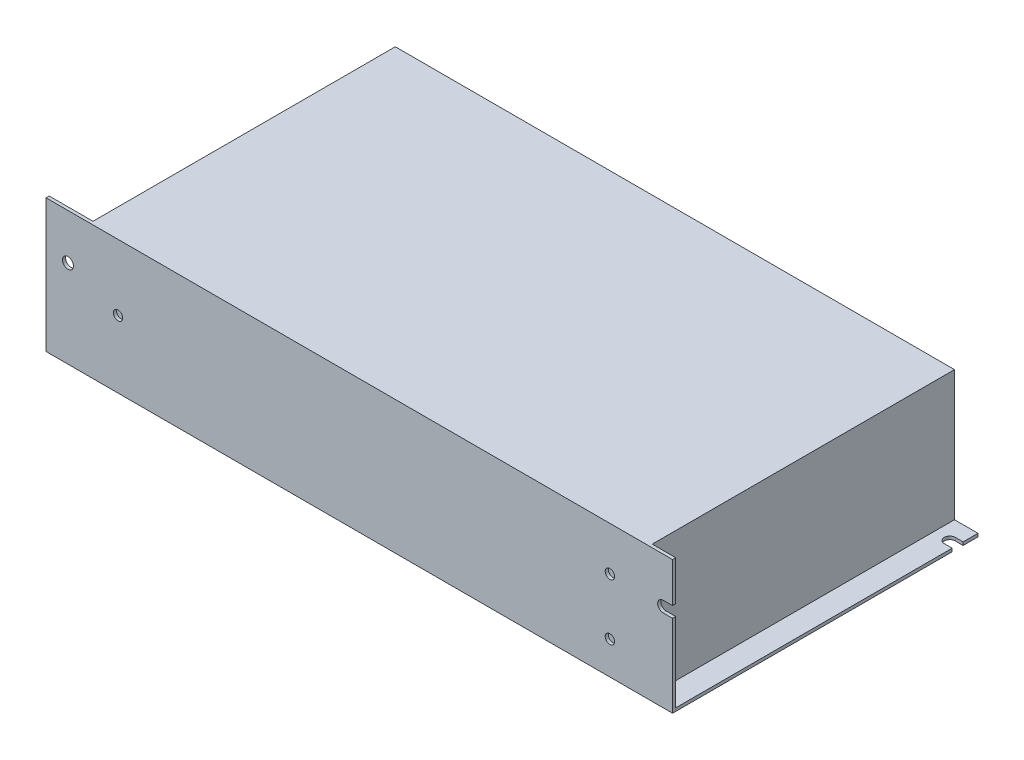
ISO-10303-21;
HEADER;
FILE_DESCRIPTION(('STEP AP214'),'2;1');
FILE_NAME('part.step','',(''),(''),'','','');
FILE_SCHEMA(('AUTOMOTIVE_DESIGN { 1 0 10303 214 1 1 1 1 }'));
ENDSEC;
DATA;
#1=APPLICATION_CONTEXT('core data for automotive mechanical design processes');
#2=APPLICATION_PROTOCOL_DEFINITION('international standard','automotive_design',2000,#1);
#3=PRODUCT_CONTEXT('',#1,'mechanical');
#4=PRODUCT('Part','Part','',(#3));
#5=PRODUCT_RELATED_PRODUCT_CATEGORY('part','',(#4));
#6=PRODUCT_DEFINITION_FORMATION('','',#4);
#7=PRODUCT_DEFINITION_CONTEXT('part definition',#1,'design');
#8=PRODUCT_DEFINITION('design','',#6,#7);
#9=PRODUCT_DEFINITION_SHAPE('','',#8);
#10=(LENGTH_UNIT() NAMED_UNIT(*) SI_UNIT(.MILLI.,.METRE.));
#11=(NAMED_UNIT(*) PLANE_ANGLE_UNIT() SI_UNIT($,.RADIAN.));
#12=(NAMED_UNIT(*) SI_UNIT($,.STERADIAN.) SOLID_ANGLE_UNIT());
#13=UNCERTAINTY_MEASURE_WITH_UNIT(LENGTH_MEASURE(1.E-05),#10,'distance_accuracy_value','');
#14=(GEOMETRIC_REPRESENTATION_CONTEXT(3) GLOBAL_UNCERTAINTY_ASSIGNED_CONTEXT((#13)) GLOBAL_UNIT_ASSIGNED_CONTEXT((#10,
#11,#12)) REPRESENTATION_CONTEXT('',''));
#15=CARTESIAN_POINT('',(0.,0.,0.));
#16=DIRECTION('',(0.,0.,1.));
#17=DIRECTION('',(1.,0.,0.));
#18=AXIS2_PLACEMENT_3D('',#15,#16,#17);
#19=CARTESIAN_POINT('',(14.,-97.510255870857,-97.5));
#20=DIRECTION('',(-1.,0.,0.));
#21=DIRECTION('',(0.,0.,1.));
#22=AXIS2_PLACEMENT_3D('',#19,#20,#21);
#23=PLANE('',#22);
#24=DIRECTION('',(0.,0.,-1.));
#25=VECTOR('',#24,1.);
#26=CARTESIAN_POINT('',(14.,1.,-97.5));
#27=LINE('',#26,#25);
#28=CARTESIAN_POINT('',(14.,1.,-87.5));
#29=VERTEX_POINT('',#28);
#30=CARTESIAN_POINT('',(14.,1.,-97.5));
#31=VERTEX_POINT('',#30);
#32=EDGE_CURVE('E213',#29,#31,#27,.T.);
#33=ORIENTED_EDGE('',*,*,#32,.F.);
#34=DIRECTION('',(0.,-1.,0.));
#35=VECTOR('',#34,1.);
#36=CARTESIAN_POINT('',(14.,24.,-87.5));
#37=LINE('',#36,#35);
#38=CARTESIAN_POINT('',(14.,24.,-87.5));
#39=VERTEX_POINT('',#38);
#40=EDGE_CURVE('E194',#39,#29,#37,.T.);
#41=ORIENTED_EDGE('',*,*,#40,.F.);
#42=DIRECTION('',(0.,0.,-1.));
#43=VECTOR('',#42,1.);
#44=CARTESIAN_POINT('',(14.,24.,-87.5));
#45=LINE('',#44,#43);
#46=CARTESIAN_POINT('',(14.,24.,-12.5));
#47=VERTEX_POINT('',#46);
#48=EDGE_CURVE('E201',#47,#39,#45,.T.);
#49=ORIENTED_EDGE('',*,*,#48,.F.);
#50=DIRECTION('',(0.,-1.,0.));
#51=VECTOR('',#50,1.);
#52=CARTESIAN_POINT('',(14.,24.,-12.5));
#53=LINE('',#52,#51);
#54=CARTESIAN_POINT('',(14.,1.,-12.5));
#55=VERTEX_POINT('',#54);
#56=EDGE_CURVE('E442',#47,#55,#53,.T.);
#57=ORIENTED_EDGE('',*,*,#56,.T.);
#58=CARTESIAN_POINT('',(14.,1.,-1.));
#59=VERTEX_POINT('',#58);
#60=EDGE_CURVE('E251',#59,#55,#27,.T.);
#61=ORIENTED_EDGE('',*,*,#60,.F.);
#62=DIRECTION('',(0.,1.,0.));
#63=VECTOR('',#62,1.);
#64=CARTESIAN_POINT('',(14.,-97.510255870857,-1.));
#65=LINE('',#64,#63);
#66=CARTESIAN_POINT('',(14.,42.5,-1.));
#67=VERTEX_POINT('',#66);
#68=EDGE_CURVE('E267',#59,#67,#65,.T.);
#69=ORIENTED_EDGE('',*,*,#68,.T.);
#70=DIRECTION('',(0.,0.,1.));
#71=VECTOR('',#70,1.);
#72=CARTESIAN_POINT('',(14.,42.5,-97.5));
#73=LINE('',#72,#71);
#74=CARTESIAN_POINT('',(14.,42.5,-97.5));
#75=VERTEX_POINT('',#74);
#76=EDGE_CURVE('E258',#75,#67,#73,.T.);
#77=ORIENTED_EDGE('',*,*,#76,.F.);
#78=DIRECTION('',(0.,1.,0.));
#79=VECTOR('',#78,1.);
#80=CARTESIAN_POINT('',(14.,-97.510255870857,-97.5));
#81=LINE('',#80,#79);
#82=EDGE_CURVE('E250',#31,#75,#81,.T.);
#83=ORIENTED_EDGE('',*,*,#82,.F.);
#84=EDGE_LOOP('',(#33,#41,#49,#57,#61,#69,#77,#83));
#85=FACE_BOUND('',#84,.T.);
#86=ADVANCED_FACE('F40',(#85),#23,.T.);
#87=CARTESIAN_POINT('',(197.5,1.,-91.));
#88=DIRECTION('',(0.,1.,0.));
#89=DIRECTION('',(0.,0.,1.));
#90=AXIS2_PLACEMENT_3D('',#87,#88,#89);
#91=PLANE('',#90);
#92=CARTESIAN_POINT('',(5.,1.,-92.5));
#93=DIRECTION('',(0.,-1.,0.));
#94=DIRECTION('',(0.,0.,-1.));
#95=AXIS2_PLACEMENT_3D('',#92,#93,#94);
#96=CIRCLE('',#95,1.5);
#97=CARTESIAN_POINT('',(5.,1.,-94.));
#98=VERTEX_POINT('',#97);
#99=EDGE_CURVE('E448',#98,#98,#96,.T.);
#100=ORIENTED_EDGE('',*,*,#99,.T.);
#101=EDGE_LOOP('',(#100));
#102=FACE_BOUND('',#101,.T.);
#103=DIRECTION('',(0.,0.,-1.));
#104=VECTOR('',#103,1.);
#105=CARTESIAN_POINT('',(0.,1.,-97.5));
#106=LINE('',#105,#104);
#107=CARTESIAN_POINT('',(0.,1.,-87.5));
#108=VERTEX_POINT('',#107);
#109=CARTESIAN_POINT('',(0.,1.,-97.5));
#110=VERTEX_POINT('',#109);
#111=EDGE_CURVE('E257',#108,#110,#106,.T.);
#112=ORIENTED_EDGE('',*,*,#111,.F.);
#113=DIRECTION('',(-1.,0.,0.));
#114=VECTOR('',#113,1.);
#115=CARTESIAN_POINT('',(14.,1.,-87.5));
#116=LINE('',#115,#114);
#117=EDGE_CURVE('E432',#29,#108,#116,.T.);
#118=ORIENTED_EDGE('',*,*,#117,.F.);
#119=ORIENTED_EDGE('',*,*,#32,.T.);
#120=DIRECTION('',(-1.,0.,0.));
#121=VECTOR('',#120,1.);
#122=CARTESIAN_POINT('',(0.,1.,-97.5));
#123=LINE('',#122,#121);
#124=EDGE_CURVE('E254',#31,#110,#123,.T.);
#125=ORIENTED_EDGE('',*,*,#124,.T.);
#126=EDGE_LOOP('',(#112,#118,#119,#125));
#127=FACE_BOUND('',#126,.T.);
#128=ADVANCED_FACE('F431',(#102,#127),#91,.T.);
#129=CARTESIAN_POINT('',(3.,1.,-7.5));
#130=DIRECTION('',(0.,1.,0.));
#131=DIRECTION('',(0.,0.,1.));
#132=AXIS2_PLACEMENT_3D('',#129,#130,#131);
#133=CIRCLE('',#132,1.5);
#134=CARTESIAN_POINT('',(3.,1.,-6.));
#135=VERTEX_POINT('',#134);
#136=EDGE_CURVE('E44',#135,#135,#133,.T.);
#137=ORIENTED_EDGE('',*,*,#136,.F.);
#138=EDGE_LOOP('',(#137));
#139=FACE_BOUND('',#138,.T.);
#140=ORIENTED_EDGE('',*,*,#60,.T.);
#141=DIRECTION('',(1.,0.,0.));
#142=VECTOR('',#141,1.);
#143=CARTESIAN_POINT('',(14.,1.,-12.5));
#144=LINE('',#143,#142);
#145=CARTESIAN_POINT('',(0.,1.,-12.5));
#146=VERTEX_POINT('',#145);
#147=EDGE_CURVE('E209',#146,#55,#144,.T.);
#148=ORIENTED_EDGE('',*,*,#147,.F.);
#149=CARTESIAN_POINT('',(0.,1.,-1.));
#150=VERTEX_POINT('',#149);
#151=EDGE_CURVE('E271',#150,#146,#106,.T.);
#152=ORIENTED_EDGE('',*,*,#151,.F.);
#153=DIRECTION('',(-1.,0.,0.));
#154=VECTOR('',#153,1.);
#155=CARTESIAN_POINT('',(0.,1.,-1.));
#156=LINE('',#155,#154);
#157=EDGE_CURVE('E248',#59,#150,#156,.T.);
#158=ORIENTED_EDGE('',*,*,#157,.F.);
#159=EDGE_LOOP('',(#140,#148,#152,#158));
#160=FACE_BOUND('',#159,.T.);
#161=ADVANCED_FACE('F540',(#139,#160),#91,.T.);
#162=CARTESIAN_POINT('',(200.,42.5,0.));
#163=DIRECTION('',(-1.,0.,0.));
#164=DIRECTION('',(0.,0.,1.));
#165=AXIS2_PLACEMENT_3D('',#162,#163,#164);
#166=PLANE('',#165);
#167=DIRECTION('',(0.,-1.,0.));
#168=VECTOR('',#167,1.);
#169=CARTESIAN_POINT('',(200.,42.5,0.));
#170=LINE('',#169,#168);
#171=CARTESIAN_POINT('',(200.,42.5,0.));
#172=VERTEX_POINT('',#171);
#173=CARTESIAN_POINT('',(200.,29.75,0.));
#174=VERTEX_POINT('',#173);
#175=EDGE_CURVE('E49',#172,#174,#170,.T.);
#176=ORIENTED_EDGE('',*,*,#175,.T.);
#177=DIRECTION('',(0.,0.,1.));
#178=VECTOR('',#177,1.);
#179=CARTESIAN_POINT('',(200.,29.75,-97.501));
#180=LINE('',#179,#178);
#181=CARTESIAN_POINT('',(200.,29.75,-1.));
#182=VERTEX_POINT('',#181);
#183=EDGE_CURVE('E243',#182,#174,#180,.T.);
#184=ORIENTED_EDGE('',*,*,#183,.F.);
#185=DIRECTION('',(0.,1.,0.));
#186=VECTOR('',#185,1.);
#187=CARTESIAN_POINT('',(200.,-97.510255870857,-1.));
#188=LINE('',#187,#186);
#189=CARTESIAN_POINT('',(200.,42.5,-1.));
#190=VERTEX_POINT('',#189);
#191=EDGE_CURVE('E284',#182,#190,#188,.T.);
#192=ORIENTED_EDGE('',*,*,#191,.T.);
#193=DIRECTION('',(0.,0.,-1.));
#194=VECTOR('',#193,1.);
#195=CARTESIAN_POINT('',(200.,42.5,0.));
#196=LINE('',#195,#194);
#197=EDGE_CURVE('E311',#172,#190,#196,.T.);
#198=ORIENTED_EDGE('',*,*,#197,.F.);
#199=EDGE_LOOP('',(#176,#184,#192,#198));
#200=FACE_BOUND('',#199,.T.);
#201=ADVANCED_FACE('F398',(#200),#166,.F.);
#202=CARTESIAN_POINT('',(197.5,42.5,-91.));
#203=DIRECTION('',(0.,1.,0.));
#204=DIRECTION('',(0.,0.,1.));
#205=AXIS2_PLACEMENT_3D('',#202,#203,#204);
#206=PLANE('',#205);
#207=DIRECTION('',(-1.,0.,0.));
#208=VECTOR('',#207,1.);
#209=CARTESIAN_POINT('',(0.,42.5,-97.5));
#210=LINE('',#209,#208);
#211=CARTESIAN_POINT('',(192.5,42.5,-97.5));
#212=VERTEX_POINT('',#211);
#213=EDGE_CURVE('E314',#212,#75,#210,.T.);
#214=ORIENTED_EDGE('',*,*,#213,.T.);
#215=ORIENTED_EDGE('',*,*,#76,.T.);
#216=DIRECTION('',(1.,0.,0.));
#217=VECTOR('',#216,1.);
#218=CARTESIAN_POINT('',(0.,42.5,-1.));
#219=LINE('',#218,#217);
#220=CARTESIAN_POINT('',(0.,42.5,-1.));
#221=VERTEX_POINT('',#220);
#222=EDGE_CURVE('E261',#221,#67,#219,.T.);
#223=ORIENTED_EDGE('',*,*,#222,.F.);
#224=DIRECTION('',(0.,0.,1.));
#225=VECTOR('',#224,1.);
#226=CARTESIAN_POINT('',(0.,42.5,0.));
#227=LINE('',#226,#225);
#228=CARTESIAN_POINT('',(0.,42.5,0.));
#229=VERTEX_POINT('',#228);
#230=EDGE_CURVE('E306',#221,#229,#227,.T.);
#231=ORIENTED_EDGE('',*,*,#230,.T.);
#232=DIRECTION('',(1.,0.,0.));
#233=VECTOR('',#232,1.);
#234=CARTESIAN_POINT('',(0.,42.5,0.));
#235=LINE('',#234,#233);
#236=EDGE_CURVE('E308',#229,#172,#235,.T.);
#237=ORIENTED_EDGE('',*,*,#236,.T.);
#238=ORIENTED_EDGE('',*,*,#197,.T.);
#239=DIRECTION('',(-1.,0.,0.));
#240=VECTOR('',#239,1.);
#241=CARTESIAN_POINT('',(200.,42.5,-1.));
#242=LINE('',#241,#240);
#243=CARTESIAN_POINT('',(192.5,42.5,-1.));
#244=VERTEX_POINT('',#243);
#245=EDGE_CURVE('E278',#190,#244,#242,.T.);
#246=ORIENTED_EDGE('',*,*,#245,.T.);
#247=DIRECTION('',(0.,0.,1.));
#248=VECTOR('',#247,1.);
#249=CARTESIAN_POINT('',(192.5,42.5,-97.5));
#250=LINE('',#249,#248);
#251=EDGE_CURVE('E262',#212,#244,#250,.T.);
#252=ORIENTED_EDGE('',*,*,#251,.F.);
#253=EDGE_LOOP('',(#214,#215,#223,#231,#237,#238,#246,#252));
#254=FACE_BOUND('',#253,.T.);
#255=ADVANCED_FACE('F402',(#254),#206,.T.);
#256=CARTESIAN_POINT('',(200.,1.,-1.));
#257=VERTEX_POINT('',#256);
#258=CARTESIAN_POINT('',(200.,26.25,-1.));
#259=VERTEX_POINT('',#258);
#260=EDGE_CURVE('E281',#257,#259,#188,.T.);
#261=ORIENTED_EDGE('',*,*,#260,.T.);
#262=DIRECTION('',(0.,0.,1.));
#263=VECTOR('',#262,1.);
#264=CARTESIAN_POINT('',(200.,26.25,-97.501));
#265=LINE('',#264,#263);
#266=CARTESIAN_POINT('',(200.,26.25,0.));
#267=VERTEX_POINT('',#266);
#268=EDGE_CURVE('E64',#259,#267,#265,.T.);
#269=ORIENTED_EDGE('',*,*,#268,.T.);
#270=CARTESIAN_POINT('',(200.,0.,0.));
#271=VERTEX_POINT('',#270);
#272=EDGE_CURVE('E351',#267,#271,#170,.T.);
#273=ORIENTED_EDGE('',*,*,#272,.T.);
#274=DIRECTION('',(0.,0.,-1.));
#275=VECTOR('',#274,1.);
#276=CARTESIAN_POINT('',(200.,0.,0.));
#277=LINE('',#276,#275);
#278=CARTESIAN_POINT('',(200.,0.,-89.25));
#279=VERTEX_POINT('',#278);
#280=EDGE_CURVE('E323',#271,#279,#277,.T.);
#281=ORIENTED_EDGE('',*,*,#280,.T.);
#282=DIRECTION('',(0.,-1.,0.));
#283=VECTOR('',#282,1.);
#284=CARTESIAN_POINT('',(200.,42.5,-89.25));
#285=LINE('',#284,#283);
#286=CARTESIAN_POINT('',(200.,1.,-89.25));
#287=VERTEX_POINT('',#286);
#288=EDGE_CURVE('E349',#287,#279,#285,.T.);
#289=ORIENTED_EDGE('',*,*,#288,.F.);
#290=DIRECTION('',(0.,0.,-1.));
#291=VECTOR('',#290,1.);
#292=CARTESIAN_POINT('',(200.,1.,-97.5));
#293=LINE('',#292,#291);
#294=EDGE_CURVE('E292',#257,#287,#293,.T.);
#295=ORIENTED_EDGE('',*,*,#294,.F.);
#296=EDGE_LOOP('',(#261,#269,#273,#281,#289,#295));
#297=FACE_BOUND('',#296,.T.);
#298=ADVANCED_FACE('F359',(#297),#166,.F.);
#299=CARTESIAN_POINT('',(197.5,42.5,-89.25));
#300=DIRECTION('',(0.,0.,1.));
#301=DIRECTION('',(1.,0.,0.));
#302=AXIS2_PLACEMENT_3D('',#299,#300,#301);
#303=PLANE('',#302);
#304=DIRECTION('',(-1.,0.,0.));
#305=VECTOR('',#304,1.);
#306=CARTESIAN_POINT('',(197.5,1.,-89.25));
#307=LINE('',#306,#305);
#308=CARTESIAN_POINT('',(197.5,1.,-89.25));
#309=VERTEX_POINT('',#308);
#310=EDGE_CURVE('E300',#287,#309,#307,.T.);
#311=ORIENTED_EDGE('',*,*,#310,.F.);
#312=ORIENTED_EDGE('',*,*,#288,.T.);
#313=DIRECTION('',(-1.,0.,0.));
#314=VECTOR('',#313,1.);
#315=CARTESIAN_POINT('',(197.5,0.,-89.25));
#316=LINE('',#315,#314);
#317=CARTESIAN_POINT('',(197.5,0.,-89.25));
#318=VERTEX_POINT('',#317);
#319=EDGE_CURVE('E326',#279,#318,#316,.T.);
#320=ORIENTED_EDGE('',*,*,#319,.T.);
#321=DIRECTION('',(0.,-1.,0.));
#322=VECTOR('',#321,1.);
#323=CARTESIAN_POINT('',(197.5,42.5,-89.25));
#324=LINE('',#323,#322);
#325=EDGE_CURVE('E347',#309,#318,#324,.T.);
#326=ORIENTED_EDGE('',*,*,#325,.F.);
#327=EDGE_LOOP('',(#311,#312,#320,#326));
#328=FACE_BOUND('',#327,.T.);
#329=ADVANCED_FACE('F378',(#328),#303,.F.);
#330=CARTESIAN_POINT('',(197.5,42.5,-91.));
#331=DIRECTION('',(0.,-1.,0.));
#332=DIRECTION('',(0.,0.,-1.));
#333=AXIS2_PLACEMENT_3D('',#330,#331,#332);
#334=CYLINDRICAL_SURFACE('',#333,1.75000000000002);
#335=CARTESIAN_POINT('',(197.5,1.,-91.));
#336=DIRECTION('',(0.,1.,0.));
#337=DIRECTION('',(0.,0.,1.));
#338=AXIS2_PLACEMENT_3D('',#335,#336,#337);
#339=CIRCLE('',#338,1.75000000000002);
#340=CARTESIAN_POINT('',(197.5,1.,-92.75));
#341=VERTEX_POINT('',#340);
#342=EDGE_CURVE('E298',#309,#341,#339,.F.);
#343=ORIENTED_EDGE('',*,*,#342,.F.);
#344=ORIENTED_EDGE('',*,*,#325,.T.);
#345=CARTESIAN_POINT('',(197.5,0.,-91.));
#346=DIRECTION('',(0.,-1.,0.));
#347=DIRECTION('',(0.,0.,1.));
#348=AXIS2_PLACEMENT_3D('',#345,#346,#347);
#349=CIRCLE('',#348,1.75000000000002);
#350=CARTESIAN_POINT('',(197.5,0.,-92.75));
#351=VERTEX_POINT('',#350);
#352=EDGE_CURVE('E329',#318,#351,#349,.T.);
#353=ORIENTED_EDGE('',*,*,#352,.T.);
#354=DIRECTION('',(0.,-1.,0.));
#355=VECTOR('',#354,1.);
#356=CARTESIAN_POINT('',(197.5,42.5,-92.75));
#357=LINE('',#356,#355);
#358=EDGE_CURVE('E345',#341,#351,#357,.T.);
#359=ORIENTED_EDGE('',*,*,#358,.F.);
#360=EDGE_LOOP('',(#343,#344,#353,#359));
#361=FACE_BOUND('',#360,.T.);
#362=ADVANCED_FACE('F424',(#361),#334,.F.);
#363=CARTESIAN_POINT('',(197.5,42.5,-92.75));
#364=DIRECTION('',(0.,0.,-1.));
#365=DIRECTION('',(-1.,0.,0.));
#366=AXIS2_PLACEMENT_3D('',#363,#364,#365);
#367=PLANE('',#366);
#368=DIRECTION('',(1.,0.,0.));
#369=VECTOR('',#368,1.);
#370=CARTESIAN_POINT('',(197.5,1.,-92.75));
#371=LINE('',#370,#369);
#372=CARTESIAN_POINT('',(200.,1.,-92.75));
#373=VERTEX_POINT('',#372);
#374=EDGE_CURVE('E296',#341,#373,#371,.T.);
#375=ORIENTED_EDGE('',*,*,#374,.F.);
#376=ORIENTED_EDGE('',*,*,#358,.T.);
#377=DIRECTION('',(1.,0.,0.));
#378=VECTOR('',#377,1.);
#379=CARTESIAN_POINT('',(197.5,0.,-92.75));
#380=LINE('',#379,#378);
#381=CARTESIAN_POINT('',(200.,0.,-92.75));
#382=VERTEX_POINT('',#381);
#383=EDGE_CURVE('E332',#351,#382,#380,.T.);
#384=ORIENTED_EDGE('',*,*,#383,.T.);
#385=DIRECTION('',(0.,-1.,0.));
#386=VECTOR('',#385,1.);
#387=CARTESIAN_POINT('',(200.,42.5,-92.75));
#388=LINE('',#387,#386);
#389=EDGE_CURVE('E343',#373,#382,#388,.T.);
#390=ORIENTED_EDGE('',*,*,#389,.F.);
#391=EDGE_LOOP('',(#375,#376,#384,#390));
#392=FACE_BOUND('',#391,.T.);
#393=ADVANCED_FACE('F421',(#392),#367,.F.);
#394=CARTESIAN_POINT('',(200.,42.5,-92.75));
#395=DIRECTION('',(-1.,0.,0.));
#396=DIRECTION('',(0.,0.,1.));
#397=AXIS2_PLACEMENT_3D('',#394,#395,#396);
#398=PLANE('',#397);
#399=CARTESIAN_POINT('',(200.,1.,-97.5));
#400=VERTEX_POINT('',#399);
#401=EDGE_CURVE('E291',#373,#400,#293,.T.);
#402=ORIENTED_EDGE('',*,*,#401,.F.);
#403=ORIENTED_EDGE('',*,*,#389,.T.);
#404=DIRECTION('',(0.,0.,-1.));
#405=VECTOR('',#404,1.);
#406=CARTESIAN_POINT('',(200.,0.,-92.75));
#407=LINE('',#406,#405);
#408=CARTESIAN_POINT('',(200.,0.,-97.5));
#409=VERTEX_POINT('',#408);
#410=EDGE_CURVE('E335',#382,#409,#407,.T.);
#411=ORIENTED_EDGE('',*,*,#410,.T.);
#412=DIRECTION('',(0.,-1.,0.));
#413=VECTOR('',#412,1.);
#414=CARTESIAN_POINT('',(200.,42.5,-97.5));
#415=LINE('',#414,#413);
#416=EDGE_CURVE('E341',#400,#409,#415,.T.);
#417=ORIENTED_EDGE('',*,*,#416,.F.);
#418=EDGE_LOOP('',(#402,#403,#411,#417));
#419=FACE_BOUND('',#418,.T.);
#420=ADVANCED_FACE('F417',(#419),#398,.F.);
#421=CARTESIAN_POINT('',(0.,42.5,-97.5));
#422=DIRECTION('',(0.,0.,1.));
#423=DIRECTION('',(1.,0.,0.));
#424=AXIS2_PLACEMENT_3D('',#421,#422,#423);
#425=PLANE('',#424);
#426=ORIENTED_EDGE('',*,*,#82,.T.);
#427=ORIENTED_EDGE('',*,*,#213,.F.);
#428=DIRECTION('',(0.,1.,0.));
#429=VECTOR('',#428,1.);
#430=CARTESIAN_POINT('',(192.5,-97.510255870857,-97.5));
#431=LINE('',#430,#429);
#432=CARTESIAN_POINT('',(192.5,1.,-97.5));
#433=VERTEX_POINT('',#432);
#434=EDGE_CURVE('E276',#433,#212,#431,.T.);
#435=ORIENTED_EDGE('',*,*,#434,.F.);
#436=DIRECTION('',(1.,0.,0.));
#437=VECTOR('',#436,1.);
#438=CARTESIAN_POINT('',(200.,1.,-97.5));
#439=LINE('',#438,#437);
#440=EDGE_CURVE('E275',#433,#400,#439,.T.);
#441=ORIENTED_EDGE('',*,*,#440,.T.);
#442=ORIENTED_EDGE('',*,*,#416,.T.);
#443=DIRECTION('',(-1.,0.,0.));
#444=VECTOR('',#443,1.);
#445=CARTESIAN_POINT('',(0.,0.,-97.5));
#446=LINE('',#445,#444);
#447=CARTESIAN_POINT('',(0.,0.,-97.5));
#448=VERTEX_POINT('',#447);
#449=EDGE_CURVE('E309',#409,#448,#446,.T.);
#450=ORIENTED_EDGE('',*,*,#449,.T.);
#451=DIRECTION('',(0.,-1.,0.));
#452=VECTOR('',#451,1.);
#453=CARTESIAN_POINT('',(0.,42.5,-97.5));
#454=LINE('',#453,#452);
#455=EDGE_CURVE('E317',#110,#448,#454,.T.);
#456=ORIENTED_EDGE('',*,*,#455,.F.);
#457=ORIENTED_EDGE('',*,*,#124,.F.);
#458=EDGE_LOOP('',(#426,#427,#435,#441,#442,#450,#456,#457));
#459=FACE_BOUND('',#458,.T.);
#460=ADVANCED_FACE('F411',(#459),#425,.F.);
#461=CARTESIAN_POINT('',(3.,42.5,-7.5));
#462=DIRECTION('',(0.,-1.,0.));
#463=DIRECTION('',(0.,0.,-1.));
#464=AXIS2_PLACEMENT_3D('',#461,#462,#463);
#465=CYLINDRICAL_SURFACE('',#464,1.5);
#466=CARTESIAN_POINT('',(3.,0.,-7.5));
#467=DIRECTION('',(0.,1.,0.));
#468=DIRECTION('',(0.,0.,1.));
#469=AXIS2_PLACEMENT_3D('',#466,#467,#468);
#470=CIRCLE('',#469,1.5);
#471=CARTESIAN_POINT('',(3.,0.,-6.));
#472=VERTEX_POINT('',#471);
#473=EDGE_CURVE('E302',#472,#472,#470,.T.);
#474=ORIENTED_EDGE('',*,*,#473,.F.);
#475=EDGE_LOOP('',(#474));
#476=FACE_BOUND('',#475,.T.);
#477=ORIENTED_EDGE('',*,*,#136,.T.);
#478=EDGE_LOOP('',(#477));
#479=FACE_BOUND('',#478,.T.);
#480=ADVANCED_FACE('F505',(#476,#479),#465,.F.);
#481=CARTESIAN_POINT('',(197.5,0.,-91.));
#482=DIRECTION('',(0.,1.,0.));
#483=DIRECTION('',(0.,0.,1.));
#484=AXIS2_PLACEMENT_3D('',#481,#482,#483);
#485=PLANE('',#484);
#486=CARTESIAN_POINT('',(5.,0.,-92.5));
#487=DIRECTION('',(0.,-1.,0.));
#488=DIRECTION('',(0.,0.,-1.));
#489=AXIS2_PLACEMENT_3D('',#486,#487,#488);
#490=CIRCLE('',#489,1.5);
#491=CARTESIAN_POINT('',(5.,0.,-94.));
#492=VERTEX_POINT('',#491);
#493=EDGE_CURVE('E484',#492,#492,#490,.T.);
#494=ORIENTED_EDGE('',*,*,#493,.F.);
#495=EDGE_LOOP('',(#494));
#496=FACE_BOUND('',#495,.T.);
#497=CARTESIAN_POINT('',(172.5,0.,-92.5));
#498=DIRECTION('',(0.,-1.,0.));
#499=DIRECTION('',(0.,0.,-1.));
#500=AXIS2_PLACEMENT_3D('',#497,#498,#499);
#501=CIRCLE('',#500,1.5);
#502=CARTESIAN_POINT('',(172.5,0.,-94.));
#503=VERTEX_POINT('',#502);
#504=EDGE_CURVE('E485',#503,#503,#501,.T.);
#505=ORIENTED_EDGE('',*,*,#504,.F.);
#506=EDGE_LOOP('',(#505));
#507=FACE_BOUND('',#506,.T.);
#508=CARTESIAN_POINT('',(180.,0.,-9.49999999999999));
#509=DIRECTION('',(0.,-1.,0.));
#510=DIRECTION('',(0.,0.,-1.));
#511=AXIS2_PLACEMENT_3D('',#508,#509,#510);
#512=CIRCLE('',#511,1.5);
#513=CARTESIAN_POINT('',(180.,0.,-11.));
#514=VERTEX_POINT('',#513);
#515=EDGE_CURVE('E459',#514,#514,#512,.T.);
#516=ORIENTED_EDGE('',*,*,#515,.F.);
#517=EDGE_LOOP('',(#516));
#518=FACE_BOUND('',#517,.T.);
#519=CARTESIAN_POINT('',(180.,0.,-89.5));
#520=DIRECTION('',(0.,-1.,0.));
#521=DIRECTION('',(0.,0.,-1.));
#522=AXIS2_PLACEMENT_3D('',#519,#520,#521);
#523=CIRCLE('',#522,1.5);
#524=CARTESIAN_POINT('',(180.,0.,-91.));
#525=VERTEX_POINT('',#524);
#526=EDGE_CURVE('E466',#525,#525,#523,.T.);
#527=ORIENTED_EDGE('',*,*,#526,.F.);
#528=EDGE_LOOP('',(#527));
#529=FACE_BOUND('',#528,.T.);
#530=CARTESIAN_POINT('',(60.,0.,-89.5));
#531=DIRECTION('',(0.,-1.,0.));
#532=DIRECTION('',(0.,0.,-1.));
#533=AXIS2_PLACEMENT_3D('',#530,#531,#532);
#534=CIRCLE('',#533,1.5);
#535=CARTESIAN_POINT('',(60.,0.,-91.));
#536=VERTEX_POINT('',#535);
#537=EDGE_CURVE('E472',#536,#536,#534,.T.);
#538=ORIENTED_EDGE('',*,*,#537,.F.);
#539=EDGE_LOOP('',(#538));
#540=FACE_BOUND('',#539,.T.);
#541=CARTESIAN_POINT('',(60.,0.,-9.49999999999999));
#542=DIRECTION('',(0.,-1.,0.));
#543=DIRECTION('',(0.,0.,-1.));
#544=AXIS2_PLACEMENT_3D('',#541,#542,#543);
#545=CIRCLE('',#544,1.5);
#546=CARTESIAN_POINT('',(60.,0.,-11.));
#547=VERTEX_POINT('',#546);
#548=EDGE_CURVE('E478',#547,#547,#545,.T.);
#549=ORIENTED_EDGE('',*,*,#548,.F.);
#550=EDGE_LOOP('',(#549));
#551=FACE_BOUND('',#550,.T.);
#552=DIRECTION('',(0.,0.,1.));
#553=VECTOR('',#552,1.);
#554=CARTESIAN_POINT('',(0.,0.,0.));
#555=LINE('',#554,#553);
#556=CARTESIAN_POINT('',(0.,0.,0.));
#557=VERTEX_POINT('',#556);
#558=EDGE_CURVE('E305',#448,#557,#555,.T.);
#559=ORIENTED_EDGE('',*,*,#558,.F.);
#560=ORIENTED_EDGE('',*,*,#449,.F.);
#561=ORIENTED_EDGE('',*,*,#410,.F.);
#562=ORIENTED_EDGE('',*,*,#383,.F.);
#563=ORIENTED_EDGE('',*,*,#352,.F.);
#564=ORIENTED_EDGE('',*,*,#319,.F.);
#565=ORIENTED_EDGE('',*,*,#280,.F.);
#566=DIRECTION('',(1.,0.,0.));
#567=VECTOR('',#566,1.);
#568=CARTESIAN_POINT('',(0.,0.,0.));
#569=LINE('',#568,#567);
#570=EDGE_CURVE('E320',#557,#271,#569,.T.);
#571=ORIENTED_EDGE('',*,*,#570,.F.);
#572=EDGE_LOOP('',(#559,#560,#561,#562,#563,#564,#565,#571));
#573=FACE_BOUND('',#572,.T.);
#574=ORIENTED_EDGE('',*,*,#473,.T.);
#575=EDGE_LOOP('',(#574));
#576=FACE_BOUND('',#575,.T.);
#577=ADVANCED_FACE('F371',(#496,#507,#518,#529,#540,#551,#573,#576),#485,.F.);
#578=CARTESIAN_POINT('',(0.,42.5,0.));
#579=DIRECTION('',(1.,0.,0.));
#580=DIRECTION('',(0.,0.,-1.));
#581=AXIS2_PLACEMENT_3D('',#578,#579,#580);
#582=PLANE('',#581);
#583=ORIENTED_EDGE('',*,*,#230,.F.);
#584=DIRECTION('',(0.,1.,0.));
#585=VECTOR('',#584,1.);
#586=CARTESIAN_POINT('',(0.,-97.510255870857,-1.));
#587=LINE('',#586,#585);
#588=EDGE_CURVE('E265',#150,#221,#587,.T.);
#589=ORIENTED_EDGE('',*,*,#588,.F.);
#590=ORIENTED_EDGE('',*,*,#151,.T.);
#591=DIRECTION('',(0.,-1.,0.));
#592=VECTOR('',#591,1.);
#593=CARTESIAN_POINT('',(0.,24.,-12.5));
#594=LINE('',#593,#592);
#595=CARTESIAN_POINT('',(0.,24.,-12.5));
#596=VERTEX_POINT('',#595);
#597=EDGE_CURVE('E56',#596,#146,#594,.T.);
#598=ORIENTED_EDGE('',*,*,#597,.F.);
#599=DIRECTION('',(0.,0.,1.));
#600=VECTOR('',#599,1.);
#601=CARTESIAN_POINT('',(0.,24.,-87.5));
#602=LINE('',#601,#600);
#603=CARTESIAN_POINT('',(0.,24.,-87.5));
#604=VERTEX_POINT('',#603);
#605=EDGE_CURVE('E200',#604,#596,#602,.T.);
#606=ORIENTED_EDGE('',*,*,#605,.F.);
#607=DIRECTION('',(0.,-1.,0.));
#608=VECTOR('',#607,1.);
#609=CARTESIAN_POINT('',(0.,24.,-87.5));
#610=LINE('',#609,#608);
#611=EDGE_CURVE('E197',#604,#108,#610,.T.);
#612=ORIENTED_EDGE('',*,*,#611,.T.);
#613=ORIENTED_EDGE('',*,*,#111,.T.);
#614=ORIENTED_EDGE('',*,*,#455,.T.);
#615=ORIENTED_EDGE('',*,*,#558,.T.);
#616=DIRECTION('',(0.,-1.,0.));
#617=VECTOR('',#616,1.);
#618=CARTESIAN_POINT('',(0.,42.5,0.));
#619=LINE('',#618,#617);
#620=EDGE_CURVE('E12',#229,#557,#619,.T.);
#621=ORIENTED_EDGE('',*,*,#620,.F.);
#622=EDGE_LOOP('',(#583,#589,#590,#598,#606,#612,#613,#614,#615,#621));
#623=FACE_BOUND('',#622,.T.);
#624=ADVANCED_FACE('F42',(#623),#582,.F.);
#625=CARTESIAN_POINT('',(0.,42.5,0.));
#626=DIRECTION('',(0.,0.,-1.));
#627=DIRECTION('',(-1.,0.,0.));
#628=AXIS2_PLACEMENT_3D('',#625,#626,#627);
#629=PLANE('',#628);
#630=CARTESIAN_POINT('',(23.,21.5,0.));
#631=DIRECTION('',(0.,0.,1.));
#632=DIRECTION('',(1.,0.,0.));
#633=AXIS2_PLACEMENT_3D('',#630,#631,#632);
#634=CIRCLE('',#633,1.5);
#635=CARTESIAN_POINT('',(24.5,21.5,0.));
#636=VERTEX_POINT('',#635);
#637=EDGE_CURVE('E437',#636,#636,#634,.T.);
#638=ORIENTED_EDGE('',*,*,#637,.F.);
#639=EDGE_LOOP('',(#638));
#640=FACE_BOUND('',#639,.T.);
#641=CARTESIAN_POINT('',(180.,10.5,0.));
#642=DIRECTION('',(0.,0.,1.));
#643=DIRECTION('',(1.,0.,0.));
#644=AXIS2_PLACEMENT_3D('',#641,#642,#643);
#645=CIRCLE('',#644,1.5);
#646=CARTESIAN_POINT('',(181.5,10.5,0.));
#647=VERTEX_POINT('',#646);
#648=EDGE_CURVE('E451',#647,#647,#645,.T.);
#649=ORIENTED_EDGE('',*,*,#648,.F.);
#650=EDGE_LOOP('',(#649));
#651=FACE_BOUND('',#650,.T.);
#652=CARTESIAN_POINT('',(180.,28.5,0.));
#653=DIRECTION('',(0.,0.,1.));
#654=DIRECTION('',(1.,0.,0.));
#655=AXIS2_PLACEMENT_3D('',#652,#653,#654);
#656=CIRCLE('',#655,1.5);
#657=CARTESIAN_POINT('',(181.5,28.5,0.));
#658=VERTEX_POINT('',#657);
#659=EDGE_CURVE('E444',#658,#658,#656,.T.);
#660=ORIENTED_EDGE('',*,*,#659,.F.);
#661=EDGE_LOOP('',(#660));
#662=FACE_BOUND('',#661,.T.);
#663=CARTESIAN_POINT('',(7.,28.,0.));
#664=DIRECTION('',(0.,0.,1.));
#665=DIRECTION('',(1.,0.,0.));
#666=AXIS2_PLACEMENT_3D('',#663,#664,#665);
#667=CIRCLE('',#666,1.75);
#668=CARTESIAN_POINT('',(8.75,28.,0.));
#669=VERTEX_POINT('',#668);
#670=EDGE_CURVE('E222',#669,#669,#667,.T.);
#671=ORIENTED_EDGE('',*,*,#670,.F.);
#672=EDGE_LOOP('',(#671));
#673=FACE_BOUND('',#672,.T.);
#674=CARTESIAN_POINT('',(197.,28.,0.));
#675=DIRECTION('',(0.,0.,1.));
#676=DIRECTION('',(1.,0.,0.));
#677=AXIS2_PLACEMENT_3D('',#674,#675,#676);
#678=CIRCLE('',#677,1.75000000000001);
#679=CARTESIAN_POINT('',(197.,29.75,0.));
#680=VERTEX_POINT('',#679);
#681=CARTESIAN_POINT('',(197.,26.25,0.));
#682=VERTEX_POINT('',#681);
#683=EDGE_CURVE('E232',#680,#682,#678,.T.);
#684=ORIENTED_EDGE('',*,*,#683,.F.);
#685=DIRECTION('',(-1.,0.,0.));
#686=VECTOR('',#685,1.);
#687=CARTESIAN_POINT('',(197.,29.75,0.));
#688=LINE('',#687,#686);
#689=EDGE_CURVE('E237',#174,#680,#688,.T.);
#690=ORIENTED_EDGE('',*,*,#689,.F.);
#691=ORIENTED_EDGE('',*,*,#175,.F.);
#692=ORIENTED_EDGE('',*,*,#236,.F.);
#693=ORIENTED_EDGE('',*,*,#620,.T.);
#694=ORIENTED_EDGE('',*,*,#570,.T.);
#695=ORIENTED_EDGE('',*,*,#272,.F.);
#696=DIRECTION('',(1.,0.,0.));
#697=VECTOR('',#696,1.);
#698=CARTESIAN_POINT('',(200.,26.25,0.));
#699=LINE('',#698,#697);
#700=EDGE_CURVE('E235',#682,#267,#699,.T.);
#701=ORIENTED_EDGE('',*,*,#700,.F.);
#702=EDGE_LOOP('',(#684,#690,#691,#692,#693,#694,#695,#701));
#703=FACE_BOUND('',#702,.T.);
#704=ADVANCED_FACE('F366',(#640,#651,#662,#673,#703),#629,.F.);
#705=CARTESIAN_POINT('',(0.,-97.510255870857,-1.));
#706=DIRECTION('',(0.,0.,1.));
#707=DIRECTION('',(1.,0.,0.));
#708=AXIS2_PLACEMENT_3D('',#705,#706,#707);
#709=PLANE('',#708);
#710=CARTESIAN_POINT('',(7.,28.,-1.));
#711=DIRECTION('',(0.,0.,1.));
#712=DIRECTION('',(1.,0.,0.));
#713=AXIS2_PLACEMENT_3D('',#710,#711,#712);
#714=CIRCLE('',#713,1.75);
#715=CARTESIAN_POINT('',(8.75,28.,-1.));
#716=VERTEX_POINT('',#715);
#717=EDGE_CURVE('E225',#716,#716,#714,.F.);
#718=ORIENTED_EDGE('',*,*,#717,.F.);
#719=EDGE_LOOP('',(#718));
#720=FACE_BOUND('',#719,.T.);
#721=ORIENTED_EDGE('',*,*,#157,.T.);
#722=ORIENTED_EDGE('',*,*,#588,.T.);
#723=ORIENTED_EDGE('',*,*,#222,.T.);
#724=ORIENTED_EDGE('',*,*,#68,.F.);
#725=EDGE_LOOP('',(#721,#722,#723,#724));
#726=FACE_BOUND('',#725,.T.);
#727=ADVANCED_FACE('F544',(#720,#726),#709,.F.);
#728=CARTESIAN_POINT('',(197.5,1.,-91.));
#729=DIRECTION('',(0.,1.,0.));
#730=DIRECTION('',(0.,0.,1.));
#731=AXIS2_PLACEMENT_3D('',#728,#729,#730);
#732=PLANE('',#731);
#733=ORIENTED_EDGE('',*,*,#310,.T.);
#734=ORIENTED_EDGE('',*,*,#342,.T.);
#735=ORIENTED_EDGE('',*,*,#374,.T.);
#736=ORIENTED_EDGE('',*,*,#401,.T.);
#737=ORIENTED_EDGE('',*,*,#440,.F.);
#738=DIRECTION('',(0.,0.,-1.));
#739=VECTOR('',#738,1.);
#740=CARTESIAN_POINT('',(192.5,1.,-97.5));
#741=LINE('',#740,#739);
#742=CARTESIAN_POINT('',(192.5,1.,-1.));
#743=VERTEX_POINT('',#742);
#744=EDGE_CURVE('E228',#743,#433,#741,.T.);
#745=ORIENTED_EDGE('',*,*,#744,.F.);
#746=DIRECTION('',(1.,0.,0.));
#747=VECTOR('',#746,1.);
#748=CARTESIAN_POINT('',(200.,1.,-1.));
#749=LINE('',#748,#747);
#750=EDGE_CURVE('E294',#743,#257,#749,.T.);
#751=ORIENTED_EDGE('',*,*,#750,.T.);
#752=ORIENTED_EDGE('',*,*,#294,.T.);
#753=EDGE_LOOP('',(#733,#734,#735,#736,#737,#745,#751,#752));
#754=FACE_BOUND('',#753,.T.);
#755=ADVANCED_FACE('F382',(#754),#732,.T.);
#756=CARTESIAN_POINT('',(200.,-97.510255870857,-1.));
#757=DIRECTION('',(0.,0.,-1.));
#758=DIRECTION('',(-1.,0.,0.));
#759=AXIS2_PLACEMENT_3D('',#756,#757,#758);
#760=PLANE('',#759);
#761=DIRECTION('',(-1.,0.,0.));
#762=VECTOR('',#761,1.);
#763=CARTESIAN_POINT('',(197.,29.75,-1.));
#764=LINE('',#763,#762);
#765=CARTESIAN_POINT('',(197.,29.75,-1.));
#766=VERTEX_POINT('',#765);
#767=EDGE_CURVE('E217',#182,#766,#764,.T.);
#768=ORIENTED_EDGE('',*,*,#767,.T.);
#769=CARTESIAN_POINT('',(197.,28.,-1.));
#770=DIRECTION('',(0.,0.,-1.));
#771=DIRECTION('',(-1.,0.,0.));
#772=AXIS2_PLACEMENT_3D('',#769,#770,#771);
#773=CIRCLE('',#772,1.75000000000001);
#774=CARTESIAN_POINT('',(197.,26.25,-1.));
#775=VERTEX_POINT('',#774);
#776=EDGE_CURVE('E214',#766,#775,#773,.F.);
#777=ORIENTED_EDGE('',*,*,#776,.T.);
#778=DIRECTION('',(1.,0.,0.));
#779=VECTOR('',#778,1.);
#780=CARTESIAN_POINT('',(200.,26.25,-1.));
#781=LINE('',#780,#779);
#782=EDGE_CURVE('E226',#775,#259,#781,.T.);
#783=ORIENTED_EDGE('',*,*,#782,.T.);
#784=ORIENTED_EDGE('',*,*,#260,.F.);
#785=ORIENTED_EDGE('',*,*,#750,.F.);
#786=DIRECTION('',(0.,1.,0.));
#787=VECTOR('',#786,1.);
#788=CARTESIAN_POINT('',(192.5,-97.510255870857,-1.));
#789=LINE('',#788,#787);
#790=EDGE_CURVE('E279',#743,#244,#789,.T.);
#791=ORIENTED_EDGE('',*,*,#790,.T.);
#792=ORIENTED_EDGE('',*,*,#245,.F.);
#793=ORIENTED_EDGE('',*,*,#191,.F.);
#794=EDGE_LOOP('',(#768,#777,#783,#784,#785,#791,#792,#793));
#795=FACE_BOUND('',#794,.T.);
#796=ADVANCED_FACE('F388',(#795),#760,.T.);
#797=CARTESIAN_POINT('',(192.5,-97.510255870857,-97.5));
#798=DIRECTION('',(-1.,0.,0.));
#799=DIRECTION('',(0.,0.,1.));
#800=AXIS2_PLACEMENT_3D('',#797,#798,#799);
#801=PLANE('',#800);
#802=ORIENTED_EDGE('',*,*,#744,.T.);
#803=ORIENTED_EDGE('',*,*,#434,.T.);
#804=ORIENTED_EDGE('',*,*,#251,.T.);
#805=ORIENTED_EDGE('',*,*,#790,.F.);
#806=EDGE_LOOP('',(#802,#803,#804,#805));
#807=FACE_BOUND('',#806,.T.);
#808=ADVANCED_FACE('F427',(#807),#801,.F.);
#809=CARTESIAN_POINT('',(197.,28.,-97.501));
#810=DIRECTION('',(0.,0.,1.));
#811=DIRECTION('',(1.,0.,0.));
#812=AXIS2_PLACEMENT_3D('',#809,#810,#811);
#813=CYLINDRICAL_SURFACE('',#812,1.75000000000001);
#814=DIRECTION('',(0.,0.,1.));
#815=VECTOR('',#814,1.);
#816=CARTESIAN_POINT('',(197.,29.75,-97.501));
#817=LINE('',#816,#815);
#818=EDGE_CURVE('E241',#766,#680,#817,.T.);
#819=ORIENTED_EDGE('',*,*,#818,.T.);
#820=ORIENTED_EDGE('',*,*,#683,.T.);
#821=DIRECTION('',(0.,0.,1.));
#822=VECTOR('',#821,1.);
#823=CARTESIAN_POINT('',(197.,26.25,-97.501));
#824=LINE('',#823,#822);
#825=EDGE_CURVE('E240',#775,#682,#824,.T.);
#826=ORIENTED_EDGE('',*,*,#825,.F.);
#827=ORIENTED_EDGE('',*,*,#776,.F.);
#828=EDGE_LOOP('',(#819,#820,#826,#827));
#829=FACE_BOUND('',#828,.T.);
#830=ADVANCED_FACE('F392',(#829),#813,.F.);
#831=CARTESIAN_POINT('',(197.,29.75,-97.501));
#832=DIRECTION('',(0.,1.,0.));
#833=DIRECTION('',(0.,0.,1.));
#834=AXIS2_PLACEMENT_3D('',#831,#832,#833);
#835=PLANE('',#834);
#836=ORIENTED_EDGE('',*,*,#183,.T.);
#837=ORIENTED_EDGE('',*,*,#689,.T.);
#838=ORIENTED_EDGE('',*,*,#818,.F.);
#839=ORIENTED_EDGE('',*,*,#767,.F.);
#840=EDGE_LOOP('',(#836,#837,#838,#839));
#841=FACE_BOUND('',#840,.T.);
#842=ADVANCED_FACE('F396',(#841),#835,.F.);
#843=CARTESIAN_POINT('',(200.,26.25,-97.501));
#844=DIRECTION('',(0.,-1.,0.));
#845=DIRECTION('',(0.,0.,-1.));
#846=AXIS2_PLACEMENT_3D('',#843,#844,#845);
#847=PLANE('',#846);
#848=ORIENTED_EDGE('',*,*,#825,.T.);
#849=ORIENTED_EDGE('',*,*,#700,.T.);
#850=ORIENTED_EDGE('',*,*,#268,.F.);
#851=ORIENTED_EDGE('',*,*,#782,.F.);
#852=EDGE_LOOP('',(#848,#849,#850,#851));
#853=FACE_BOUND('',#852,.T.);
#854=ADVANCED_FACE('F390',(#853),#847,.F.);
#855=CARTESIAN_POINT('',(7.,28.,-97.501));
#856=DIRECTION('',(0.,0.,1.));
#857=DIRECTION('',(1.,0.,0.));
#858=AXIS2_PLACEMENT_3D('',#855,#856,#857);
#859=CYLINDRICAL_SURFACE('',#858,1.75);
#860=ORIENTED_EDGE('',*,*,#670,.T.);
#861=EDGE_LOOP('',(#860));
#862=FACE_BOUND('',#861,.T.);
#863=ORIENTED_EDGE('',*,*,#717,.T.);
#864=EDGE_LOOP('',(#863));
#865=FACE_BOUND('',#864,.T.);
#866=ADVANCED_FACE('F582',(#862,#865),#859,.F.);
#867=CARTESIAN_POINT('',(14.,24.,-87.5));
#868=DIRECTION('',(0.,0.,1.));
#869=DIRECTION('',(1.,0.,0.));
#870=AXIS2_PLACEMENT_3D('',#867,#868,#869);
#871=PLANE('',#870);
#872=ORIENTED_EDGE('',*,*,#117,.T.);
#873=ORIENTED_EDGE('',*,*,#611,.F.);
#874=DIRECTION('',(-1.,0.,0.));
#875=VECTOR('',#874,1.);
#876=CARTESIAN_POINT('',(14.,24.,-87.5));
#877=LINE('',#876,#875);
#878=EDGE_CURVE('E190',#39,#604,#877,.T.);
#879=ORIENTED_EDGE('',*,*,#878,.F.);
#880=ORIENTED_EDGE('',*,*,#40,.T.);
#881=EDGE_LOOP('',(#872,#873,#879,#880));
#882=FACE_BOUND('',#881,.T.);
#883=ADVANCED_FACE('F192',(#882),#871,.F.);
#884=CARTESIAN_POINT('',(14.,24.,-12.5));
#885=DIRECTION('',(0.,0.,-1.));
#886=DIRECTION('',(-1.,0.,0.));
#887=AXIS2_PLACEMENT_3D('',#884,#885,#886);
#888=PLANE('',#887);
#889=ORIENTED_EDGE('',*,*,#147,.T.);
#890=ORIENTED_EDGE('',*,*,#56,.F.);
#891=DIRECTION('',(1.,0.,0.));
#892=VECTOR('',#891,1.);
#893=CARTESIAN_POINT('',(14.,24.,-12.5));
#894=LINE('',#893,#892);
#895=EDGE_CURVE('E205',#596,#47,#894,.T.);
#896=ORIENTED_EDGE('',*,*,#895,.F.);
#897=ORIENTED_EDGE('',*,*,#597,.T.);
#898=EDGE_LOOP('',(#889,#890,#896,#897));
#899=FACE_BOUND('',#898,.T.);
#900=ADVANCED_FACE('F591',(#899),#888,.F.);
#901=CARTESIAN_POINT('',(0.,24.,0.));
#902=DIRECTION('',(0.,-1.,0.));
#903=DIRECTION('',(0.,0.,-1.));
#904=AXIS2_PLACEMENT_3D('',#901,#902,#903);
#905=PLANE('',#904);
#906=ORIENTED_EDGE('',*,*,#48,.T.);
#907=ORIENTED_EDGE('',*,*,#878,.T.);
#908=ORIENTED_EDGE('',*,*,#605,.T.);
#909=ORIENTED_EDGE('',*,*,#895,.T.);
#910=EDGE_LOOP('',(#906,#907,#908,#909));
#911=FACE_BOUND('',#910,.T.);
#912=ADVANCED_FACE('F204',(#911),#905,.F.);
#913=CARTESIAN_POINT('',(180.,28.5,-1.));
#914=DIRECTION('',(0.,0.,1.));
#915=DIRECTION('',(1.,0.,0.));
#916=AXIS2_PLACEMENT_3D('',#913,#914,#915);
#917=CYLINDRICAL_SURFACE('',#916,1.5);
#918=CARTESIAN_POINT('',(180.,28.5,-1.));
#919=DIRECTION('',(0.,0.,1.));
#920=DIRECTION('',(1.,0.,0.));
#921=AXIS2_PLACEMENT_3D('',#918,#919,#920);
#922=CIRCLE('',#921,1.5);
#923=CARTESIAN_POINT('',(181.5,28.5,-1.));
#924=VERTEX_POINT('',#923);
#925=EDGE_CURVE('E447',#924,#924,#922,.T.);
#926=ORIENTED_EDGE('',*,*,#925,.F.);
#927=EDGE_LOOP('',(#926));
#928=FACE_BOUND('',#927,.T.);
#929=ORIENTED_EDGE('',*,*,#659,.T.);
#930=EDGE_LOOP('',(#929));
#931=FACE_BOUND('',#930,.T.);
#932=ADVANCED_FACE('F598',(#928,#931),#917,.F.);
#933=CARTESIAN_POINT('',(180.,28.5,-1.));
#934=DIRECTION('',(0.,0.,1.));
#935=DIRECTION('',(1.,0.,0.));
#936=AXIS2_PLACEMENT_3D('',#933,#934,#935);
#937=PLANE('',#936);
#938=ORIENTED_EDGE('',*,*,#925,.T.);
#939=EDGE_LOOP('',(#938));
#940=FACE_BOUND('',#939,.T.);
#941=ADVANCED_FACE('F658',(#940),#937,.T.);
#942=CARTESIAN_POINT('',(180.,10.5,-1.));
#943=DIRECTION('',(0.,0.,1.));
#944=DIRECTION('',(1.,0.,0.));
#945=AXIS2_PLACEMENT_3D('',#942,#943,#944);
#946=CYLINDRICAL_SURFACE('',#945,1.5);
#947=CARTESIAN_POINT('',(180.,10.5,-1.));
#948=DIRECTION('',(0.,0.,1.));
#949=DIRECTION('',(1.,0.,0.));
#950=AXIS2_PLACEMENT_3D('',#947,#948,#949);
#951=CIRCLE('',#950,1.5);
#952=CARTESIAN_POINT('',(181.5,10.5,-1.));
#953=VERTEX_POINT('',#952);
#954=EDGE_CURVE('E454',#953,#953,#951,.T.);
#955=ORIENTED_EDGE('',*,*,#954,.F.);
#956=EDGE_LOOP('',(#955));
#957=FACE_BOUND('',#956,.T.);
#958=ORIENTED_EDGE('',*,*,#648,.T.);
#959=EDGE_LOOP('',(#958));
#960=FACE_BOUND('',#959,.T.);
#961=ADVANCED_FACE('F667',(#957,#960),#946,.F.);
#962=CARTESIAN_POINT('',(180.,10.5,-1.));
#963=DIRECTION('',(0.,0.,1.));
#964=DIRECTION('',(1.,0.,0.));
#965=AXIS2_PLACEMENT_3D('',#962,#963,#964);
#966=PLANE('',#965);
#967=ORIENTED_EDGE('',*,*,#954,.T.);
#968=EDGE_LOOP('',(#967));
#969=FACE_BOUND('',#968,.T.);
#970=ADVANCED_FACE('F677',(#969),#966,.T.);
#971=CARTESIAN_POINT('',(23.,21.5,-1.));
#972=DIRECTION('',(0.,0.,1.));
#973=DIRECTION('',(1.,0.,0.));
#974=AXIS2_PLACEMENT_3D('',#971,#972,#973);
#975=CYLINDRICAL_SURFACE('',#974,1.5);
#976=CARTESIAN_POINT('',(23.,21.5,-1.));
#977=DIRECTION('',(0.,0.,1.));
#978=DIRECTION('',(1.,0.,0.));
#979=AXIS2_PLACEMENT_3D('',#976,#977,#978);
#980=CIRCLE('',#979,1.5);
#981=CARTESIAN_POINT('',(24.5,21.5,-1.));
#982=VERTEX_POINT('',#981);
#983=EDGE_CURVE('E433',#982,#982,#980,.T.);
#984=ORIENTED_EDGE('',*,*,#983,.F.);
#985=EDGE_LOOP('',(#984));
#986=FACE_BOUND('',#985,.T.);
#987=ORIENTED_EDGE('',*,*,#637,.T.);
#988=EDGE_LOOP('',(#987));
#989=FACE_BOUND('',#988,.T.);
#990=ADVANCED_FACE('F530',(#986,#989),#975,.F.);
#991=CARTESIAN_POINT('',(23.,21.5,-1.));
#992=DIRECTION('',(0.,0.,1.));
#993=DIRECTION('',(1.,0.,0.));
#994=AXIS2_PLACEMENT_3D('',#991,#992,#993);
#995=PLANE('',#994);
#996=ORIENTED_EDGE('',*,*,#983,.T.);
#997=EDGE_LOOP('',(#996));
#998=FACE_BOUND('',#997,.T.);
#999=ADVANCED_FACE('F520',(#998),#995,.T.);
#1000=CARTESIAN_POINT('',(60.,1.,-9.49999999999999));
#1001=DIRECTION('',(0.,-1.,0.));
#1002=DIRECTION('',(0.,0.,-1.));
#1003=AXIS2_PLACEMENT_3D('',#1000,#1001,#1002);
#1004=CYLINDRICAL_SURFACE('',#1003,1.5);
#1005=CARTESIAN_POINT('',(60.,1.,-9.49999999999999));
#1006=DIRECTION('',(0.,-1.,0.));
#1007=DIRECTION('',(0.,0.,-1.));
#1008=AXIS2_PLACEMENT_3D('',#1005,#1006,#1007);
#1009=CIRCLE('',#1008,1.5);
#1010=CARTESIAN_POINT('',(60.,1.,-11.));
#1011=VERTEX_POINT('',#1010);
#1012=EDGE_CURVE('E481',#1011,#1011,#1009,.T.);
#1013=ORIENTED_EDGE('',*,*,#1012,.F.);
#1014=EDGE_LOOP('',(#1013));
#1015=FACE_BOUND('',#1014,.T.);
#1016=ORIENTED_EDGE('',*,*,#548,.T.);
#1017=EDGE_LOOP('',(#1016));
#1018=FACE_BOUND('',#1017,.T.);
#1019=ADVANCED_FACE('F517',(#1015,#1018),#1004,.F.);
#1020=CARTESIAN_POINT('',(60.,1.,-9.49999999999999));
#1021=DIRECTION('',(0.,-1.,0.));
#1022=DIRECTION('',(0.,0.,-1.));
#1023=AXIS2_PLACEMENT_3D('',#1020,#1021,#1022);
#1024=PLANE('',#1023);
#1025=ORIENTED_EDGE('',*,*,#1012,.T.);
#1026=EDGE_LOOP('',(#1025));
#1027=FACE_BOUND('',#1026,.T.);
#1028=ADVANCED_FACE('F519',(#1027),#1024,.T.);
#1029=CARTESIAN_POINT('',(60.,1.,-89.5));
#1030=DIRECTION('',(0.,-1.,0.));
#1031=DIRECTION('',(0.,0.,-1.));
#1032=AXIS2_PLACEMENT_3D('',#1029,#1030,#1031);
#1033=CYLINDRICAL_SURFACE('',#1032,1.5);
#1034=CARTESIAN_POINT('',(60.,1.,-89.5));
#1035=DIRECTION('',(0.,-1.,0.));
#1036=DIRECTION('',(0.,0.,-1.));
#1037=AXIS2_PLACEMENT_3D('',#1034,#1035,#1036);
#1038=CIRCLE('',#1037,1.5);
#1039=CARTESIAN_POINT('',(60.,1.,-91.));
#1040=VERTEX_POINT('',#1039);
#1041=EDGE_CURVE('E475',#1040,#1040,#1038,.T.);
#1042=ORIENTED_EDGE('',*,*,#1041,.F.);
#1043=EDGE_LOOP('',(#1042));
#1044=FACE_BOUND('',#1043,.T.);
#1045=ORIENTED_EDGE('',*,*,#537,.T.);
#1046=EDGE_LOOP('',(#1045));
#1047=FACE_BOUND('',#1046,.T.);
#1048=ADVANCED_FACE('F527',(#1044,#1047),#1033,.F.);
#1049=CARTESIAN_POINT('',(60.,1.,-89.5));
#1050=DIRECTION('',(0.,-1.,0.));
#1051=DIRECTION('',(0.,0.,-1.));
#1052=AXIS2_PLACEMENT_3D('',#1049,#1050,#1051);
#1053=PLANE('',#1052);
#1054=ORIENTED_EDGE('',*,*,#1041,.T.);
#1055=EDGE_LOOP('',(#1054));
#1056=FACE_BOUND('',#1055,.T.);
#1057=ADVANCED_FACE('F737',(#1056),#1053,.T.);
#1058=CARTESIAN_POINT('',(180.,1.,-89.5));
#1059=DIRECTION('',(0.,-1.,0.));
#1060=DIRECTION('',(0.,0.,-1.));
#1061=AXIS2_PLACEMENT_3D('',#1058,#1059,#1060);
#1062=CYLINDRICAL_SURFACE('',#1061,1.5);
#1063=CARTESIAN_POINT('',(180.,1.,-89.5));
#1064=DIRECTION('',(0.,-1.,0.));
#1065=DIRECTION('',(0.,0.,-1.));
#1066=AXIS2_PLACEMENT_3D('',#1063,#1064,#1065);
#1067=CIRCLE('',#1066,1.5);
#1068=CARTESIAN_POINT('',(180.,1.,-91.));
#1069=VERTEX_POINT('',#1068);
#1070=EDGE_CURVE('E469',#1069,#1069,#1067,.T.);
#1071=ORIENTED_EDGE('',*,*,#1070,.F.);
#1072=EDGE_LOOP('',(#1071));
#1073=FACE_BOUND('',#1072,.T.);
#1074=ORIENTED_EDGE('',*,*,#526,.T.);
#1075=EDGE_LOOP('',(#1074));
#1076=FACE_BOUND('',#1075,.T.);
#1077=ADVANCED_FACE('F747',(#1073,#1076),#1062,.F.);
#1078=CARTESIAN_POINT('',(180.,1.,-89.5));
#1079=DIRECTION('',(0.,-1.,0.));
#1080=DIRECTION('',(0.,0.,-1.));
#1081=AXIS2_PLACEMENT_3D('',#1078,#1079,#1080);
#1082=PLANE('',#1081);
#1083=ORIENTED_EDGE('',*,*,#1070,.T.);
#1084=EDGE_LOOP('',(#1083));
#1085=FACE_BOUND('',#1084,.T.);
#1086=ADVANCED_FACE('F756',(#1085),#1082,.T.);
#1087=CARTESIAN_POINT('',(180.,1.,-9.49999999999999));
#1088=DIRECTION('',(0.,-1.,0.));
#1089=DIRECTION('',(0.,0.,-1.));
#1090=AXIS2_PLACEMENT_3D('',#1087,#1088,#1089);
#1091=CYLINDRICAL_SURFACE('',#1090,1.5);
#1092=CARTESIAN_POINT('',(180.,1.,-9.49999999999999));
#1093=DIRECTION('',(0.,-1.,0.));
#1094=DIRECTION('',(0.,0.,-1.));
#1095=AXIS2_PLACEMENT_3D('',#1092,#1093,#1094);
#1096=CIRCLE('',#1095,1.5);
#1097=CARTESIAN_POINT('',(180.,1.,-11.));
#1098=VERTEX_POINT('',#1097);
#1099=EDGE_CURVE('E462',#1098,#1098,#1096,.T.);
#1100=ORIENTED_EDGE('',*,*,#1099,.F.);
#1101=EDGE_LOOP('',(#1100));
#1102=FACE_BOUND('',#1101,.T.);
#1103=ORIENTED_EDGE('',*,*,#515,.T.);
#1104=EDGE_LOOP('',(#1103));
#1105=FACE_BOUND('',#1104,.T.);
#1106=ADVANCED_FACE('F766',(#1102,#1105),#1091,.F.);
#1107=CARTESIAN_POINT('',(180.,1.,-9.49999999999999));
#1108=DIRECTION('',(0.,-1.,0.));
#1109=DIRECTION('',(0.,0.,-1.));
#1110=AXIS2_PLACEMENT_3D('',#1107,#1108,#1109);
#1111=PLANE('',#1110);
#1112=ORIENTED_EDGE('',*,*,#1099,.T.);
#1113=EDGE_LOOP('',(#1112));
#1114=FACE_BOUND('',#1113,.T.);
#1115=ADVANCED_FACE('F776',(#1114),#1111,.T.);
#1116=CARTESIAN_POINT('',(172.5,1.,-92.5));
#1117=DIRECTION('',(0.,-1.,0.));
#1118=DIRECTION('',(0.,0.,-1.));
#1119=AXIS2_PLACEMENT_3D('',#1116,#1117,#1118);
#1120=CYLINDRICAL_SURFACE('',#1119,1.5);
#1121=CARTESIAN_POINT('',(172.5,1.,-92.5));
#1122=DIRECTION('',(0.,-1.,0.));
#1123=DIRECTION('',(0.,0.,-1.));
#1124=AXIS2_PLACEMENT_3D('',#1121,#1122,#1123);
#1125=CIRCLE('',#1124,1.5);
#1126=CARTESIAN_POINT('',(172.5,1.,-94.));
#1127=VERTEX_POINT('',#1126);
#1128=EDGE_CURVE('E463',#1127,#1127,#1125,.T.);
#1129=ORIENTED_EDGE('',*,*,#1128,.F.);
#1130=EDGE_LOOP('',(#1129));
#1131=FACE_BOUND('',#1130,.T.);
#1132=ORIENTED_EDGE('',*,*,#504,.T.);
#1133=EDGE_LOOP('',(#1132));
#1134=FACE_BOUND('',#1133,.T.);
#1135=ADVANCED_FACE('F786',(#1131,#1134),#1120,.F.);
#1136=CARTESIAN_POINT('',(172.5,1.,-92.5));
#1137=DIRECTION('',(0.,-1.,0.));
#1138=DIRECTION('',(0.,0.,-1.));
#1139=AXIS2_PLACEMENT_3D('',#1136,#1137,#1138);
#1140=PLANE('',#1139);
#1141=ORIENTED_EDGE('',*,*,#1128,.T.);
#1142=EDGE_LOOP('',(#1141));
#1143=FACE_BOUND('',#1142,.T.);
#1144=ADVANCED_FACE('F499',(#1143),#1140,.T.);
#1145=CARTESIAN_POINT('',(5.,1.,-92.5));
#1146=DIRECTION('',(0.,-1.,0.));
#1147=DIRECTION('',(0.,0.,-1.));
#1148=AXIS2_PLACEMENT_3D('',#1145,#1146,#1147);
#1149=CYLINDRICAL_SURFACE('',#1148,1.5);
#1150=ORIENTED_EDGE('',*,*,#99,.F.);
#1151=EDGE_LOOP('',(#1150));
#1152=FACE_BOUND('',#1151,.T.);
#1153=ORIENTED_EDGE('',*,*,#493,.T.);
#1154=EDGE_LOOP('',(#1153));
#1155=FACE_BOUND('',#1154,.T.);
#1156=ADVANCED_FACE('F496',(#1152,#1155),#1149,.F.);
#1157=CLOSED_SHELL('',(#86,#128,#161,#201,#255,#298,#329,#362,#393,#420,#460,#480,#577,#624,
#704,#727,#755,#796,#808,#830,#842,#854,#866,#883,#900,#912,#932,#941,#961,#970,#990,#999,#1019,
#1028,#1048,#1057,#1077,#1086,#1106,#1115,#1135,#1144,#1156));
#1158=MANIFOLD_SOLID_BREP('B2',#1157);
#1159=ADVANCED_BREP_SHAPE_REPRESENTATION('',(#18,#1158),#14);
#1160=SHAPE_DEFINITION_REPRESENTATION(#9,#1159);
ENDSEC;
END-ISO-10303-21;
